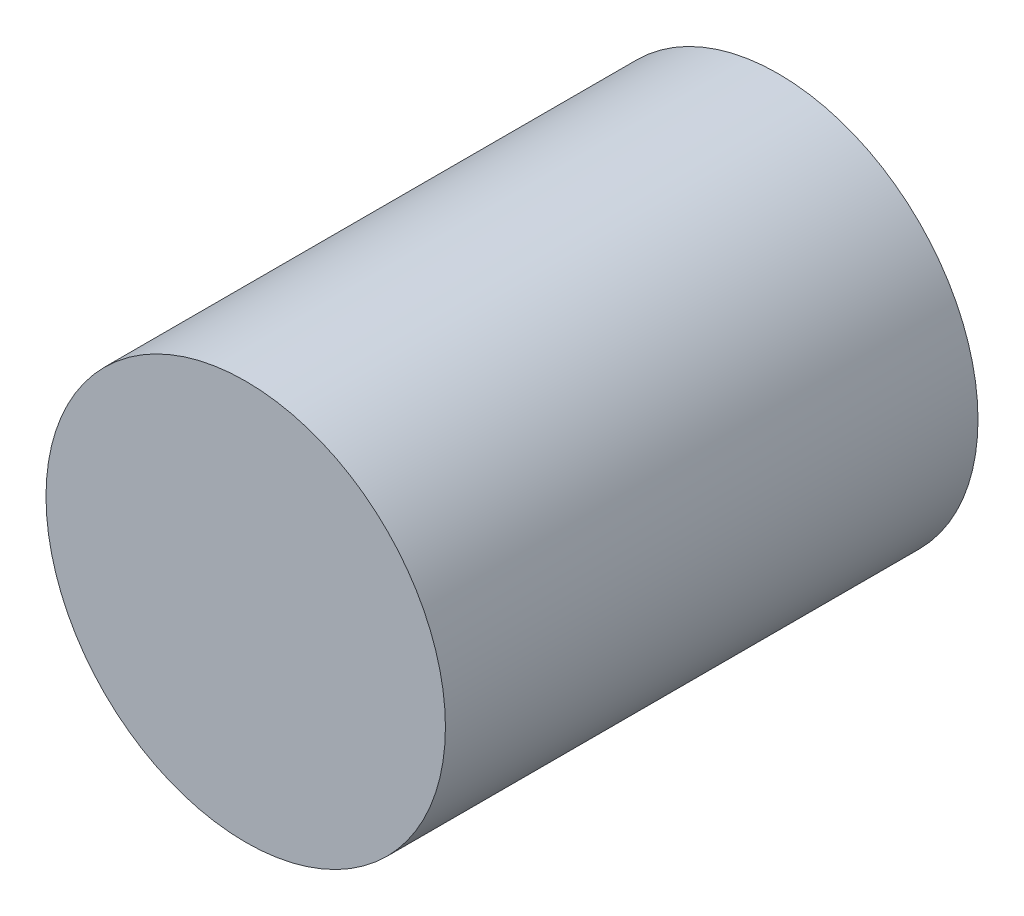
ISO-10303-21;
HEADER;
FILE_DESCRIPTION(('STEP AP214'),'2;1');
FILE_NAME('part.step','',(''),(''),'','','');
FILE_SCHEMA(('AUTOMOTIVE_DESIGN { 1 0 10303 214 1 1 1 1 }'));
ENDSEC;
DATA;
#1=APPLICATION_CONTEXT('core data for automotive mechanical design processes');
#2=APPLICATION_PROTOCOL_DEFINITION('international standard','automotive_design',2000,#1);
#3=PRODUCT_CONTEXT('',#1,'mechanical');
#4=PRODUCT('Part','Part','',(#3));
#5=PRODUCT_RELATED_PRODUCT_CATEGORY('part','',(#4));
#6=PRODUCT_DEFINITION_FORMATION('','',#4);
#7=PRODUCT_DEFINITION_CONTEXT('part definition',#1,'design');
#8=PRODUCT_DEFINITION('design','',#6,#7);
#9=PRODUCT_DEFINITION_SHAPE('','',#8);
#10=(LENGTH_UNIT() NAMED_UNIT(*) SI_UNIT(.MILLI.,.METRE.));
#11=(NAMED_UNIT(*) PLANE_ANGLE_UNIT() SI_UNIT($,.RADIAN.));
#12=(NAMED_UNIT(*) SI_UNIT($,.STERADIAN.) SOLID_ANGLE_UNIT());
#13=UNCERTAINTY_MEASURE_WITH_UNIT(LENGTH_MEASURE(1.E-05),#10,'distance_accuracy_value','');
#14=(GEOMETRIC_REPRESENTATION_CONTEXT(3) GLOBAL_UNCERTAINTY_ASSIGNED_CONTEXT((#13)) GLOBAL_UNIT_ASSIGNED_CONTEXT((#10,
#11,#12)) REPRESENTATION_CONTEXT('',''));
#15=CARTESIAN_POINT('',(0.,0.,0.));
#16=DIRECTION('',(0.,0.,1.));
#17=DIRECTION('',(1.,0.,0.));
#18=AXIS2_PLACEMENT_3D('',#15,#16,#17);
#19=CARTESIAN_POINT('',(0.,0.,12.7));
#20=DIRECTION('',(0.,0.,-1.));
#21=DIRECTION('',(-1.,0.,0.));
#22=AXIS2_PLACEMENT_3D('',#19,#20,#21);
#23=CYLINDRICAL_SURFACE('',#22,4.7625);
#24=CARTESIAN_POINT('',(0.,0.,12.7));
#25=DIRECTION('',(0.,0.,1.));
#26=DIRECTION('',(1.,0.,0.));
#27=AXIS2_PLACEMENT_3D('',#24,#25,#26);
#28=CIRCLE('',#27,4.7625);
#29=CARTESIAN_POINT('',(4.7625,0.,12.7));
#30=VERTEX_POINT('',#29);
#31=EDGE_CURVE('E12',#30,#30,#28,.T.);
#32=ORIENTED_EDGE('',*,*,#31,.F.);
#33=EDGE_LOOP('',(#32));
#34=FACE_BOUND('',#33,.T.);
#35=CARTESIAN_POINT('',(0.,0.,0.));
#36=DIRECTION('',(0.,0.,1.));
#37=DIRECTION('',(1.,0.,0.));
#38=AXIS2_PLACEMENT_3D('',#35,#36,#37);
#39=CIRCLE('',#38,4.7625);
#40=CARTESIAN_POINT('',(4.7625,0.,0.));
#41=VERTEX_POINT('',#40);
#42=EDGE_CURVE('E49',#41,#41,#39,.T.);
#43=ORIENTED_EDGE('',*,*,#42,.T.);
#44=EDGE_LOOP('',(#43));
#45=FACE_BOUND('',#44,.T.);
#46=ADVANCED_FACE('F43',(#34,#45),#23,.T.);
#47=CARTESIAN_POINT('',(0.,0.,12.7));
#48=DIRECTION('',(0.,0.,1.));
#49=DIRECTION('',(1.,0.,0.));
#50=AXIS2_PLACEMENT_3D('',#47,#48,#49);
#51=PLANE('',#50);
#52=ORIENTED_EDGE('',*,*,#31,.T.);
#53=EDGE_LOOP('',(#52));
#54=FACE_BOUND('',#53,.T.);
#55=ADVANCED_FACE('F58',(#54),#51,.T.);
#56=CARTESIAN_POINT('',(0.,0.,0.));
#57=DIRECTION('',(0.,0.,1.));
#58=DIRECTION('',(1.,0.,0.));
#59=AXIS2_PLACEMENT_3D('',#56,#57,#58);
#60=PLANE('',#59);
#61=ORIENTED_EDGE('',*,*,#42,.F.);
#62=EDGE_LOOP('',(#61));
#63=FACE_BOUND('',#62,.T.);
#64=ADVANCED_FACE('F56',(#63),#60,.F.);
#65=CLOSED_SHELL('',(#46,#55,#64));
#66=MANIFOLD_SOLID_BREP('B2',#65);
#67=ADVANCED_BREP_SHAPE_REPRESENTATION('',(#18,#66),#14);
#68=SHAPE_DEFINITION_REPRESENTATION(#9,#67);
ENDSEC;
END-ISO-10303-21;
